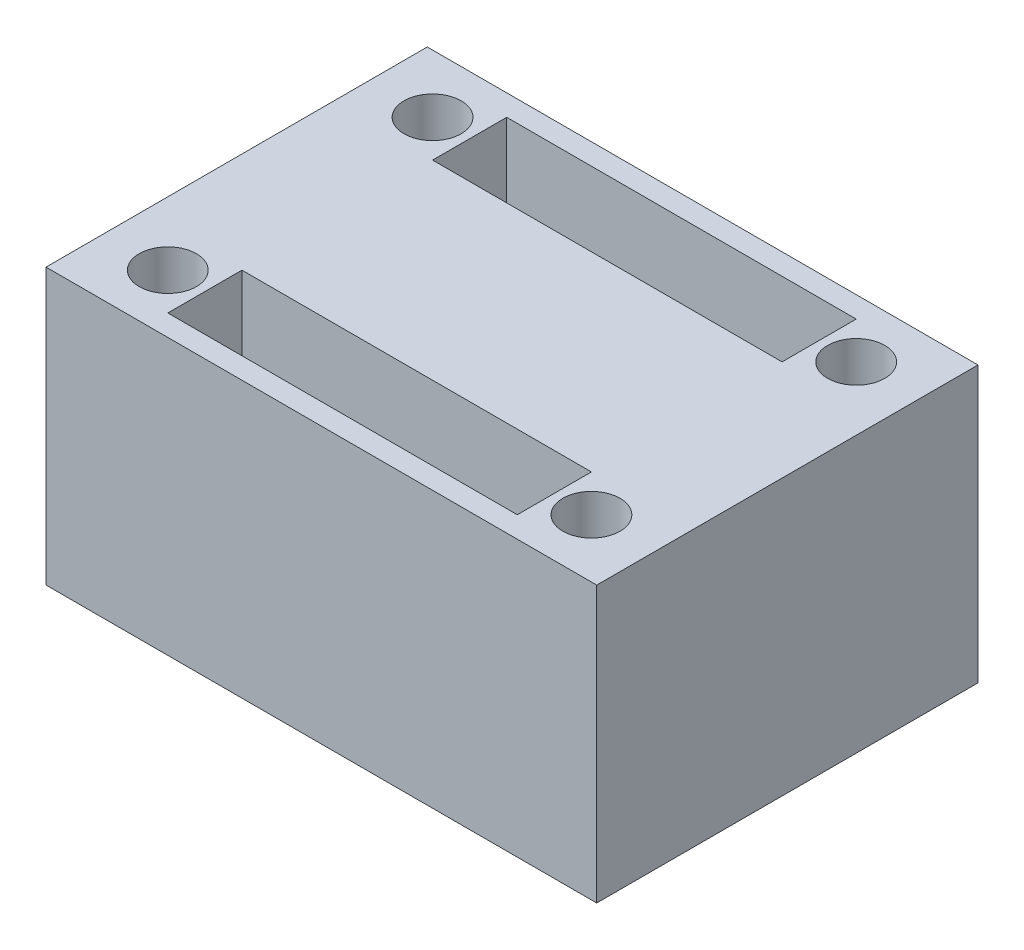
ISO-10303-21;
HEADER;
FILE_DESCRIPTION(('STEP AP214'),'2;1');
FILE_NAME('part.step','',(''),(''),'','','');
FILE_SCHEMA(('AUTOMOTIVE_DESIGN { 1 0 10303 214 1 1 1 1 }'));
ENDSEC;
DATA;
#1=APPLICATION_CONTEXT('core data for automotive mechanical design processes');
#2=APPLICATION_PROTOCOL_DEFINITION('international standard','automotive_design',2000,#1);
#3=PRODUCT_CONTEXT('',#1,'mechanical');
#4=PRODUCT('Part','Part','',(#3));
#5=PRODUCT_RELATED_PRODUCT_CATEGORY('part','',(#4));
#6=PRODUCT_DEFINITION_FORMATION('','',#4);
#7=PRODUCT_DEFINITION_CONTEXT('part definition',#1,'design');
#8=PRODUCT_DEFINITION('design','',#6,#7);
#9=PRODUCT_DEFINITION_SHAPE('','',#8);
#10=(LENGTH_UNIT() NAMED_UNIT(*) SI_UNIT(.MILLI.,.METRE.));
#11=(NAMED_UNIT(*) PLANE_ANGLE_UNIT() SI_UNIT($,.RADIAN.));
#12=(NAMED_UNIT(*) SI_UNIT($,.STERADIAN.) SOLID_ANGLE_UNIT());
#13=UNCERTAINTY_MEASURE_WITH_UNIT(LENGTH_MEASURE(1.E-05),#10,'distance_accuracy_value','');
#14=(GEOMETRIC_REPRESENTATION_CONTEXT(3) GLOBAL_UNCERTAINTY_ASSIGNED_CONTEXT((#13)) GLOBAL_UNIT_ASSIGNED_CONTEXT((#10,
#11,#12)) REPRESENTATION_CONTEXT('',''));
#15=CARTESIAN_POINT('',(0.,0.,0.));
#16=DIRECTION('',(0.,0.,1.));
#17=DIRECTION('',(1.,0.,0.));
#18=AXIS2_PLACEMENT_3D('',#15,#16,#17);
#19=CARTESIAN_POINT('',(0.,13.,0.));
#20=DIRECTION('',(1.,0.,0.));
#21=DIRECTION('',(0.,0.,-1.));
#22=AXIS2_PLACEMENT_3D('',#19,#20,#21);
#23=PLANE('',#22);
#24=DIRECTION('',(0.,0.,1.));
#25=VECTOR('',#24,1.);
#26=CARTESIAN_POINT('',(0.,0.,0.));
#27=LINE('',#26,#25);
#28=CARTESIAN_POINT('',(0.,0.,-18.));
#29=VERTEX_POINT('',#28);
#30=CARTESIAN_POINT('',(0.,0.,0.));
#31=VERTEX_POINT('',#30);
#32=EDGE_CURVE('E249',#29,#31,#27,.T.);
#33=ORIENTED_EDGE('',*,*,#32,.T.);
#34=DIRECTION('',(0.,-1.,0.));
#35=VECTOR('',#34,1.);
#36=CARTESIAN_POINT('',(0.,13.,0.));
#37=LINE('',#36,#35);
#38=CARTESIAN_POINT('',(0.,13.,0.));
#39=VERTEX_POINT('',#38);
#40=EDGE_CURVE('E11',#39,#31,#37,.T.);
#41=ORIENTED_EDGE('',*,*,#40,.F.);
#42=DIRECTION('',(0.,0.,1.));
#43=VECTOR('',#42,1.);
#44=CARTESIAN_POINT('',(0.,13.,0.));
#45=LINE('',#44,#43);
#46=CARTESIAN_POINT('',(0.,13.,-18.));
#47=VERTEX_POINT('',#46);
#48=EDGE_CURVE('E253',#47,#39,#45,.T.);
#49=ORIENTED_EDGE('',*,*,#48,.F.);
#50=DIRECTION('',(0.,-1.,0.));
#51=VECTOR('',#50,1.);
#52=CARTESIAN_POINT('',(0.,13.,-18.));
#53=LINE('',#52,#51);
#54=EDGE_CURVE('E267',#47,#29,#53,.T.);
#55=ORIENTED_EDGE('',*,*,#54,.T.);
#56=EDGE_LOOP('',(#33,#41,#49,#55));
#57=FACE_BOUND('',#56,.T.);
#58=ADVANCED_FACE('F38',(#57),#23,.F.);
#59=CARTESIAN_POINT('',(0.,13.,0.));
#60=DIRECTION('',(0.,0.,-1.));
#61=DIRECTION('',(-1.,0.,0.));
#62=AXIS2_PLACEMENT_3D('',#59,#60,#61);
#63=PLANE('',#62);
#64=DIRECTION('',(1.,0.,0.));
#65=VECTOR('',#64,1.);
#66=CARTESIAN_POINT('',(0.,0.,0.));
#67=LINE('',#66,#65);
#68=CARTESIAN_POINT('',(26.,0.,0.));
#69=VERTEX_POINT('',#68);
#70=EDGE_CURVE('E271',#31,#69,#67,.T.);
#71=ORIENTED_EDGE('',*,*,#70,.T.);
#72=DIRECTION('',(0.,-1.,0.));
#73=VECTOR('',#72,1.);
#74=CARTESIAN_POINT('',(26.,13.,0.));
#75=LINE('',#74,#73);
#76=CARTESIAN_POINT('',(26.,13.,0.));
#77=VERTEX_POINT('',#76);
#78=EDGE_CURVE('E46',#77,#69,#75,.T.);
#79=ORIENTED_EDGE('',*,*,#78,.F.);
#80=DIRECTION('',(1.,0.,0.));
#81=VECTOR('',#80,1.);
#82=CARTESIAN_POINT('',(0.,13.,0.));
#83=LINE('',#82,#81);
#84=EDGE_CURVE('E257',#39,#77,#83,.T.);
#85=ORIENTED_EDGE('',*,*,#84,.F.);
#86=ORIENTED_EDGE('',*,*,#40,.T.);
#87=EDGE_LOOP('',(#71,#79,#85,#86));
#88=FACE_BOUND('',#87,.T.);
#89=ADVANCED_FACE('F306',(#88),#63,.F.);
#90=CARTESIAN_POINT('',(26.,13.,0.));
#91=DIRECTION('',(-1.,0.,0.));
#92=DIRECTION('',(0.,0.,1.));
#93=AXIS2_PLACEMENT_3D('',#90,#91,#92);
#94=PLANE('',#93);
#95=DIRECTION('',(0.,0.,-1.));
#96=VECTOR('',#95,1.);
#97=CARTESIAN_POINT('',(26.,0.,0.));
#98=LINE('',#97,#96);
#99=CARTESIAN_POINT('',(26.,0.,-18.));
#100=VERTEX_POINT('',#99);
#101=EDGE_CURVE('E274',#69,#100,#98,.T.);
#102=ORIENTED_EDGE('',*,*,#101,.T.);
#103=DIRECTION('',(0.,-1.,0.));
#104=VECTOR('',#103,1.);
#105=CARTESIAN_POINT('',(26.,13.,-18.));
#106=LINE('',#105,#104);
#107=CARTESIAN_POINT('',(26.,13.,-18.));
#108=VERTEX_POINT('',#107);
#109=EDGE_CURVE('E282',#108,#100,#106,.T.);
#110=ORIENTED_EDGE('',*,*,#109,.F.);
#111=DIRECTION('',(0.,0.,-1.));
#112=VECTOR('',#111,1.);
#113=CARTESIAN_POINT('',(26.,13.,0.));
#114=LINE('',#113,#112);
#115=EDGE_CURVE('E261',#77,#108,#114,.T.);
#116=ORIENTED_EDGE('',*,*,#115,.F.);
#117=ORIENTED_EDGE('',*,*,#78,.T.);
#118=EDGE_LOOP('',(#102,#110,#116,#117));
#119=FACE_BOUND('',#118,.T.);
#120=ADVANCED_FACE('F291',(#119),#94,.F.);
#121=CARTESIAN_POINT('',(0.,13.,-18.));
#122=DIRECTION('',(0.,0.,1.));
#123=DIRECTION('',(1.,0.,0.));
#124=AXIS2_PLACEMENT_3D('',#121,#122,#123);
#125=PLANE('',#124);
#126=DIRECTION('',(-1.,0.,0.));
#127=VECTOR('',#126,1.);
#128=CARTESIAN_POINT('',(0.,0.,-18.));
#129=LINE('',#128,#127);
#130=EDGE_CURVE('E258',#100,#29,#129,.T.);
#131=ORIENTED_EDGE('',*,*,#130,.T.);
#132=ORIENTED_EDGE('',*,*,#54,.F.);
#133=DIRECTION('',(-1.,0.,0.));
#134=VECTOR('',#133,1.);
#135=CARTESIAN_POINT('',(0.,13.,-18.));
#136=LINE('',#135,#134);
#137=EDGE_CURVE('E264',#108,#47,#136,.T.);
#138=ORIENTED_EDGE('',*,*,#137,.F.);
#139=ORIENTED_EDGE('',*,*,#109,.T.);
#140=EDGE_LOOP('',(#131,#132,#138,#139));
#141=FACE_BOUND('',#140,.T.);
#142=ADVANCED_FACE('F299',(#141),#125,.F.);
#143=CARTESIAN_POINT('',(0.,13.,0.));
#144=DIRECTION('',(0.,-1.,0.));
#145=DIRECTION('',(0.,0.,-1.));
#146=AXIS2_PLACEMENT_3D('',#143,#144,#145);
#147=PLANE('',#146);
#148=DIRECTION('',(1.,0.,0.));
#149=VECTOR('',#148,1.);
#150=CARTESIAN_POINT('',(4.75,13.,-0.999999999999996));
#151=LINE('',#150,#149);
#152=CARTESIAN_POINT('',(4.75,13.,-0.999999999999996));
#153=VERTEX_POINT('',#152);
#154=CARTESIAN_POINT('',(21.25,13.,-0.999999999999998));
#155=VERTEX_POINT('',#154);
#156=EDGE_CURVE('E208',#153,#155,#151,.T.);
#157=ORIENTED_EDGE('',*,*,#156,.F.);
#158=DIRECTION('',(0.,0.,1.));
#159=VECTOR('',#158,1.);
#160=CARTESIAN_POINT('',(4.75,13.,-4.5));
#161=LINE('',#160,#159);
#162=CARTESIAN_POINT('',(4.75,13.,-4.5));
#163=VERTEX_POINT('',#162);
#164=EDGE_CURVE('E53',#163,#153,#161,.T.);
#165=ORIENTED_EDGE('',*,*,#164,.F.);
#166=DIRECTION('',(-1.,0.,0.));
#167=VECTOR('',#166,1.);
#168=CARTESIAN_POINT('',(4.75,13.,-4.5));
#169=LINE('',#168,#167);
#170=CARTESIAN_POINT('',(21.25,13.,-4.5));
#171=VERTEX_POINT('',#170);
#172=EDGE_CURVE('E193',#171,#163,#169,.T.);
#173=ORIENTED_EDGE('',*,*,#172,.F.);
#174=DIRECTION('',(0.,0.,-1.));
#175=VECTOR('',#174,1.);
#176=CARTESIAN_POINT('',(21.25,13.,-4.5));
#177=LINE('',#176,#175);
#178=EDGE_CURVE('E212',#155,#171,#177,.T.);
#179=ORIENTED_EDGE('',*,*,#178,.F.);
#180=EDGE_LOOP('',(#157,#165,#173,#179));
#181=FACE_BOUND('',#180,.T.);
#182=CARTESIAN_POINT('',(23.,13.,-2.75));
#183=DIRECTION('',(0.,1.,0.));
#184=DIRECTION('',(0.,0.,1.));
#185=AXIS2_PLACEMENT_3D('',#182,#183,#184);
#186=CIRCLE('',#185,1.35);
#187=CARTESIAN_POINT('',(23.,13.,-1.4));
#188=VERTEX_POINT('',#187);
#189=EDGE_CURVE('E183',#188,#188,#186,.T.);
#190=ORIENTED_EDGE('',*,*,#189,.F.);
#191=EDGE_LOOP('',(#190));
#192=FACE_BOUND('',#191,.T.);
#193=CARTESIAN_POINT('',(3.,13.,-2.75));
#194=DIRECTION('',(0.,1.,0.));
#195=DIRECTION('',(0.,0.,1.));
#196=AXIS2_PLACEMENT_3D('',#193,#194,#195);
#197=CIRCLE('',#196,1.35);
#198=CARTESIAN_POINT('',(3.,13.,-1.4));
#199=VERTEX_POINT('',#198);
#200=EDGE_CURVE('E182',#199,#199,#197,.T.);
#201=ORIENTED_EDGE('',*,*,#200,.F.);
#202=EDGE_LOOP('',(#201));
#203=FACE_BOUND('',#202,.T.);
#204=CARTESIAN_POINT('',(23.,13.,-15.25));
#205=DIRECTION('',(0.,1.,0.));
#206=DIRECTION('',(0.,0.,1.));
#207=AXIS2_PLACEMENT_3D('',#204,#205,#206);
#208=CIRCLE('',#207,1.35);
#209=CARTESIAN_POINT('',(23.,13.,-13.9));
#210=VERTEX_POINT('',#209);
#211=EDGE_CURVE('E234',#210,#210,#208,.T.);
#212=ORIENTED_EDGE('',*,*,#211,.F.);
#213=EDGE_LOOP('',(#212));
#214=FACE_BOUND('',#213,.T.);
#215=DIRECTION('',(0.,0.,-1.));
#216=VECTOR('',#215,1.);
#217=CARTESIAN_POINT('',(21.25,13.,-13.5));
#218=LINE('',#217,#216);
#219=CARTESIAN_POINT('',(21.25,13.,-13.5));
#220=VERTEX_POINT('',#219);
#221=CARTESIAN_POINT('',(21.25,13.,-17.));
#222=VERTEX_POINT('',#221);
#223=EDGE_CURVE('E164',#220,#222,#218,.T.);
#224=ORIENTED_EDGE('',*,*,#223,.F.);
#225=DIRECTION('',(1.,0.,0.));
#226=VECTOR('',#225,1.);
#227=CARTESIAN_POINT('',(4.75,13.,-13.5));
#228=LINE('',#227,#226);
#229=CARTESIAN_POINT('',(4.75,13.,-13.5));
#230=VERTEX_POINT('',#229);
#231=EDGE_CURVE('E61',#230,#220,#228,.T.);
#232=ORIENTED_EDGE('',*,*,#231,.F.);
#233=DIRECTION('',(0.,0.,1.));
#234=VECTOR('',#233,1.);
#235=CARTESIAN_POINT('',(4.75,13.,-13.5));
#236=LINE('',#235,#234);
#237=CARTESIAN_POINT('',(4.75,13.,-17.));
#238=VERTEX_POINT('',#237);
#239=EDGE_CURVE('E151',#238,#230,#236,.T.);
#240=ORIENTED_EDGE('',*,*,#239,.F.);
#241=DIRECTION('',(-1.,0.,0.));
#242=VECTOR('',#241,1.);
#243=CARTESIAN_POINT('',(4.75,13.,-17.));
#244=LINE('',#243,#242);
#245=EDGE_CURVE('E155',#222,#238,#244,.T.);
#246=ORIENTED_EDGE('',*,*,#245,.F.);
#247=EDGE_LOOP('',(#224,#232,#240,#246));
#248=FACE_BOUND('',#247,.T.);
#249=CARTESIAN_POINT('',(3.,13.,-15.25));
#250=DIRECTION('',(0.,1.,0.));
#251=DIRECTION('',(0.,0.,1.));
#252=AXIS2_PLACEMENT_3D('',#249,#250,#251);
#253=CIRCLE('',#252,1.35);
#254=CARTESIAN_POINT('',(3.,13.,-13.9));
#255=VERTEX_POINT('',#254);
#256=EDGE_CURVE('E233',#255,#255,#253,.T.);
#257=ORIENTED_EDGE('',*,*,#256,.F.);
#258=EDGE_LOOP('',(#257));
#259=FACE_BOUND('',#258,.T.);
#260=ORIENTED_EDGE('',*,*,#48,.T.);
#261=ORIENTED_EDGE('',*,*,#84,.T.);
#262=ORIENTED_EDGE('',*,*,#115,.T.);
#263=ORIENTED_EDGE('',*,*,#137,.T.);
#264=EDGE_LOOP('',(#260,#261,#262,#263));
#265=FACE_BOUND('',#264,.T.);
#266=ADVANCED_FACE('F305',(#181,#192,#203,#214,#248,#259,#265),#147,.F.);
#267=CARTESIAN_POINT('',(0.,0.,0.));
#268=DIRECTION('',(0.,-1.,0.));
#269=DIRECTION('',(0.,0.,-1.));
#270=AXIS2_PLACEMENT_3D('',#267,#268,#269);
#271=PLANE('',#270);
#272=DIRECTION('',(0.,0.,1.));
#273=VECTOR('',#272,1.);
#274=CARTESIAN_POINT('',(4.75,0.,-4.5));
#275=LINE('',#274,#273);
#276=CARTESIAN_POINT('',(4.75,0.,-4.5));
#277=VERTEX_POINT('',#276);
#278=CARTESIAN_POINT('',(4.75,0.,-0.999999999999996));
#279=VERTEX_POINT('',#278);
#280=EDGE_CURVE('E188',#277,#279,#275,.T.);
#281=ORIENTED_EDGE('',*,*,#280,.T.);
#282=DIRECTION('',(1.,0.,0.));
#283=VECTOR('',#282,1.);
#284=CARTESIAN_POINT('',(4.75,0.,-0.999999999999996));
#285=LINE('',#284,#283);
#286=CARTESIAN_POINT('',(21.25,0.,-0.999999999999998));
#287=VERTEX_POINT('',#286);
#288=EDGE_CURVE('E192',#279,#287,#285,.T.);
#289=ORIENTED_EDGE('',*,*,#288,.T.);
#290=DIRECTION('',(0.,0.,-1.));
#291=VECTOR('',#290,1.);
#292=CARTESIAN_POINT('',(21.25,0.,-4.5));
#293=LINE('',#292,#291);
#294=CARTESIAN_POINT('',(21.25,0.,-4.5));
#295=VERTEX_POINT('',#294);
#296=EDGE_CURVE('E197',#287,#295,#293,.T.);
#297=ORIENTED_EDGE('',*,*,#296,.T.);
#298=DIRECTION('',(-1.,0.,0.));
#299=VECTOR('',#298,1.);
#300=CARTESIAN_POINT('',(4.75,0.,-4.5));
#301=LINE('',#300,#299);
#302=EDGE_CURVE('E201',#295,#277,#301,.T.);
#303=ORIENTED_EDGE('',*,*,#302,.T.);
#304=EDGE_LOOP('',(#281,#289,#297,#303));
#305=FACE_BOUND('',#304,.T.);
#306=CARTESIAN_POINT('',(23.,0.,-2.75));
#307=DIRECTION('',(0.,1.,0.));
#308=DIRECTION('',(0.,0.,1.));
#309=AXIS2_PLACEMENT_3D('',#306,#307,#308);
#310=CIRCLE('',#309,1.35);
#311=CARTESIAN_POINT('',(23.,0.,-1.4));
#312=VERTEX_POINT('',#311);
#313=EDGE_CURVE('E178',#312,#312,#310,.T.);
#314=ORIENTED_EDGE('',*,*,#313,.T.);
#315=EDGE_LOOP('',(#314));
#316=FACE_BOUND('',#315,.T.);
#317=CARTESIAN_POINT('',(3.,0.,-2.75));
#318=DIRECTION('',(0.,1.,0.));
#319=DIRECTION('',(0.,0.,1.));
#320=AXIS2_PLACEMENT_3D('',#317,#318,#319);
#321=CIRCLE('',#320,1.35);
#322=CARTESIAN_POINT('',(3.,0.,-1.4));
#323=VERTEX_POINT('',#322);
#324=EDGE_CURVE('E238',#323,#323,#321,.T.);
#325=ORIENTED_EDGE('',*,*,#324,.T.);
#326=EDGE_LOOP('',(#325));
#327=FACE_BOUND('',#326,.T.);
#328=CARTESIAN_POINT('',(23.,0.,-15.25));
#329=DIRECTION('',(0.,1.,0.));
#330=DIRECTION('',(0.,0.,1.));
#331=AXIS2_PLACEMENT_3D('',#328,#329,#330);
#332=CIRCLE('',#331,1.35);
#333=CARTESIAN_POINT('',(23.,0.,-13.9));
#334=VERTEX_POINT('',#333);
#335=EDGE_CURVE('E229',#334,#334,#332,.T.);
#336=ORIENTED_EDGE('',*,*,#335,.T.);
#337=EDGE_LOOP('',(#336));
#338=FACE_BOUND('',#337,.T.);
#339=DIRECTION('',(1.,0.,0.));
#340=VECTOR('',#339,1.);
#341=CARTESIAN_POINT('',(4.75,0.,-13.5));
#342=LINE('',#341,#340);
#343=CARTESIAN_POINT('',(4.75,0.,-13.5));
#344=VERTEX_POINT('',#343);
#345=CARTESIAN_POINT('',(21.25,0.,-13.5));
#346=VERTEX_POINT('',#345);
#347=EDGE_CURVE('E129',#344,#346,#342,.T.);
#348=ORIENTED_EDGE('',*,*,#347,.T.);
#349=DIRECTION('',(0.,0.,-1.));
#350=VECTOR('',#349,1.);
#351=CARTESIAN_POINT('',(21.25,0.,-13.5));
#352=LINE('',#351,#350);
#353=CARTESIAN_POINT('',(21.25,0.,-17.));
#354=VERTEX_POINT('',#353);
#355=EDGE_CURVE('E140',#346,#354,#352,.T.);
#356=ORIENTED_EDGE('',*,*,#355,.T.);
#357=DIRECTION('',(-1.,0.,0.));
#358=VECTOR('',#357,1.);
#359=CARTESIAN_POINT('',(4.75,0.,-17.));
#360=LINE('',#359,#358);
#361=CARTESIAN_POINT('',(4.75,0.,-17.));
#362=VERTEX_POINT('',#361);
#363=EDGE_CURVE('E145',#354,#362,#360,.T.);
#364=ORIENTED_EDGE('',*,*,#363,.T.);
#365=DIRECTION('',(0.,0.,1.));
#366=VECTOR('',#365,1.);
#367=CARTESIAN_POINT('',(4.75,0.,-13.5));
#368=LINE('',#367,#366);
#369=EDGE_CURVE('E136',#362,#344,#368,.T.);
#370=ORIENTED_EDGE('',*,*,#369,.T.);
#371=EDGE_LOOP('',(#348,#356,#364,#370));
#372=FACE_BOUND('',#371,.T.);
#373=CARTESIAN_POINT('',(3.,0.,-15.25));
#374=DIRECTION('',(0.,1.,0.));
#375=DIRECTION('',(0.,0.,1.));
#376=AXIS2_PLACEMENT_3D('',#373,#374,#375);
#377=CIRCLE('',#376,1.35);
#378=CARTESIAN_POINT('',(3.,0.,-13.9));
#379=VERTEX_POINT('',#378);
#380=EDGE_CURVE('E245',#379,#379,#377,.T.);
#381=ORIENTED_EDGE('',*,*,#380,.T.);
#382=EDGE_LOOP('',(#381));
#383=FACE_BOUND('',#382,.T.);
#384=ORIENTED_EDGE('',*,*,#32,.F.);
#385=ORIENTED_EDGE('',*,*,#130,.F.);
#386=ORIENTED_EDGE('',*,*,#101,.F.);
#387=ORIENTED_EDGE('',*,*,#70,.F.);
#388=EDGE_LOOP('',(#384,#385,#386,#387));
#389=FACE_BOUND('',#388,.T.);
#390=ADVANCED_FACE('F147',(#305,#316,#327,#338,#372,#383,#389),#271,.T.);
#391=CARTESIAN_POINT('',(3.,0.,-15.25));
#392=DIRECTION('',(0.,1.,0.));
#393=DIRECTION('',(0.,0.,1.));
#394=AXIS2_PLACEMENT_3D('',#391,#392,#393);
#395=CYLINDRICAL_SURFACE('',#394,1.35);
#396=ORIENTED_EDGE('',*,*,#380,.F.);
#397=EDGE_LOOP('',(#396));
#398=FACE_BOUND('',#397,.T.);
#399=ORIENTED_EDGE('',*,*,#256,.T.);
#400=EDGE_LOOP('',(#399));
#401=FACE_BOUND('',#400,.T.);
#402=ADVANCED_FACE('F318',(#398,#401),#395,.F.);
#403=CARTESIAN_POINT('',(4.75,0.,-13.5));
#404=DIRECTION('',(0.,0.,1.));
#405=DIRECTION('',(1.,0.,0.));
#406=AXIS2_PLACEMENT_3D('',#403,#404,#405);
#407=PLANE('',#406);
#408=ORIENTED_EDGE('',*,*,#231,.T.);
#409=DIRECTION('',(0.,1.,0.));
#410=VECTOR('',#409,1.);
#411=CARTESIAN_POINT('',(21.25,0.,-13.5));
#412=LINE('',#411,#410);
#413=EDGE_CURVE('E125',#346,#220,#412,.T.);
#414=ORIENTED_EDGE('',*,*,#413,.F.);
#415=ORIENTED_EDGE('',*,*,#347,.F.);
#416=DIRECTION('',(0.,1.,0.));
#417=VECTOR('',#416,1.);
#418=CARTESIAN_POINT('',(4.75,0.,-13.5));
#419=LINE('',#418,#417);
#420=EDGE_CURVE('E170',#344,#230,#419,.T.);
#421=ORIENTED_EDGE('',*,*,#420,.T.);
#422=EDGE_LOOP('',(#408,#414,#415,#421));
#423=FACE_BOUND('',#422,.T.);
#424=ADVANCED_FACE('F127',(#423),#407,.F.);
#425=CARTESIAN_POINT('',(4.75,0.,-13.5));
#426=DIRECTION('',(-1.,0.,0.));
#427=DIRECTION('',(0.,0.,1.));
#428=AXIS2_PLACEMENT_3D('',#425,#426,#427);
#429=PLANE('',#428);
#430=ORIENTED_EDGE('',*,*,#239,.T.);
#431=ORIENTED_EDGE('',*,*,#420,.F.);
#432=ORIENTED_EDGE('',*,*,#369,.F.);
#433=DIRECTION('',(0.,1.,0.));
#434=VECTOR('',#433,1.);
#435=CARTESIAN_POINT('',(4.75,0.,-17.));
#436=LINE('',#435,#434);
#437=EDGE_CURVE('E173',#362,#238,#436,.T.);
#438=ORIENTED_EDGE('',*,*,#437,.T.);
#439=EDGE_LOOP('',(#430,#431,#432,#438));
#440=FACE_BOUND('',#439,.T.);
#441=ADVANCED_FACE('F355',(#440),#429,.F.);
#442=CARTESIAN_POINT('',(4.75,0.,-17.));
#443=DIRECTION('',(0.,0.,-1.));
#444=DIRECTION('',(-1.,0.,0.));
#445=AXIS2_PLACEMENT_3D('',#442,#443,#444);
#446=PLANE('',#445);
#447=ORIENTED_EDGE('',*,*,#245,.T.);
#448=ORIENTED_EDGE('',*,*,#437,.F.);
#449=ORIENTED_EDGE('',*,*,#363,.F.);
#450=DIRECTION('',(0.,1.,0.));
#451=VECTOR('',#450,1.);
#452=CARTESIAN_POINT('',(21.25,0.,-17.));
#453=LINE('',#452,#451);
#454=EDGE_CURVE('E135',#354,#222,#453,.T.);
#455=ORIENTED_EDGE('',*,*,#454,.T.);
#456=EDGE_LOOP('',(#447,#448,#449,#455));
#457=FACE_BOUND('',#456,.T.);
#458=ADVANCED_FACE('F358',(#457),#446,.F.);
#459=CARTESIAN_POINT('',(21.25,0.,-13.5));
#460=DIRECTION('',(1.,0.,0.));
#461=DIRECTION('',(0.,0.,-1.));
#462=AXIS2_PLACEMENT_3D('',#459,#460,#461);
#463=PLANE('',#462);
#464=ORIENTED_EDGE('',*,*,#223,.T.);
#465=ORIENTED_EDGE('',*,*,#454,.F.);
#466=ORIENTED_EDGE('',*,*,#355,.F.);
#467=ORIENTED_EDGE('',*,*,#413,.T.);
#468=EDGE_LOOP('',(#464,#465,#466,#467));
#469=FACE_BOUND('',#468,.T.);
#470=ADVANCED_FACE('F141',(#469),#463,.F.);
#471=CARTESIAN_POINT('',(23.,0.,-15.25));
#472=DIRECTION('',(0.,1.,0.));
#473=DIRECTION('',(0.,0.,1.));
#474=AXIS2_PLACEMENT_3D('',#471,#472,#473);
#475=CYLINDRICAL_SURFACE('',#474,1.35);
#476=ORIENTED_EDGE('',*,*,#335,.F.);
#477=EDGE_LOOP('',(#476));
#478=FACE_BOUND('',#477,.T.);
#479=ORIENTED_EDGE('',*,*,#211,.T.);
#480=EDGE_LOOP('',(#479));
#481=FACE_BOUND('',#480,.T.);
#482=ADVANCED_FACE('F330',(#478,#481),#475,.F.);
#483=CARTESIAN_POINT('',(3.,0.,-2.75));
#484=DIRECTION('',(0.,1.,0.));
#485=DIRECTION('',(0.,0.,1.));
#486=AXIS2_PLACEMENT_3D('',#483,#484,#485);
#487=CYLINDRICAL_SURFACE('',#486,1.35);
#488=ORIENTED_EDGE('',*,*,#324,.F.);
#489=EDGE_LOOP('',(#488));
#490=FACE_BOUND('',#489,.T.);
#491=ORIENTED_EDGE('',*,*,#200,.T.);
#492=EDGE_LOOP('',(#491));
#493=FACE_BOUND('',#492,.T.);
#494=ADVANCED_FACE('F326',(#490,#493),#487,.F.);
#495=CARTESIAN_POINT('',(23.,0.,-2.75));
#496=DIRECTION('',(0.,1.,0.));
#497=DIRECTION('',(0.,0.,1.));
#498=AXIS2_PLACEMENT_3D('',#495,#496,#497);
#499=CYLINDRICAL_SURFACE('',#498,1.35);
#500=ORIENTED_EDGE('',*,*,#313,.F.);
#501=EDGE_LOOP('',(#500));
#502=FACE_BOUND('',#501,.T.);
#503=ORIENTED_EDGE('',*,*,#189,.T.);
#504=EDGE_LOOP('',(#503));
#505=FACE_BOUND('',#504,.T.);
#506=ADVANCED_FACE('F329',(#502,#505),#499,.F.);
#507=CARTESIAN_POINT('',(4.75,0.,-4.5));
#508=DIRECTION('',(-1.,0.,0.));
#509=DIRECTION('',(0.,0.,1.));
#510=AXIS2_PLACEMENT_3D('',#507,#508,#509);
#511=PLANE('',#510);
#512=ORIENTED_EDGE('',*,*,#164,.T.);
#513=DIRECTION('',(0.,1.,0.));
#514=VECTOR('',#513,1.);
#515=CARTESIAN_POINT('',(4.75,0.,-0.999999999999996));
#516=LINE('',#515,#514);
#517=EDGE_CURVE('E205',#279,#153,#516,.T.);
#518=ORIENTED_EDGE('',*,*,#517,.F.);
#519=ORIENTED_EDGE('',*,*,#280,.F.);
#520=DIRECTION('',(0.,1.,0.));
#521=VECTOR('',#520,1.);
#522=CARTESIAN_POINT('',(4.75,0.,-4.5));
#523=LINE('',#522,#521);
#524=EDGE_CURVE('E187',#277,#163,#523,.T.);
#525=ORIENTED_EDGE('',*,*,#524,.T.);
#526=EDGE_LOOP('',(#512,#518,#519,#525));
#527=FACE_BOUND('',#526,.T.);
#528=ADVANCED_FACE('F335',(#527),#511,.F.);
#529=CARTESIAN_POINT('',(4.75,0.,-4.5));
#530=DIRECTION('',(0.,0.,-1.));
#531=DIRECTION('',(-1.,0.,0.));
#532=AXIS2_PLACEMENT_3D('',#529,#530,#531);
#533=PLANE('',#532);
#534=ORIENTED_EDGE('',*,*,#172,.T.);
#535=ORIENTED_EDGE('',*,*,#524,.F.);
#536=ORIENTED_EDGE('',*,*,#302,.F.);
#537=DIRECTION('',(0.,1.,0.));
#538=VECTOR('',#537,1.);
#539=CARTESIAN_POINT('',(21.25,0.,-4.5));
#540=LINE('',#539,#538);
#541=EDGE_CURVE('E221',#295,#171,#540,.T.);
#542=ORIENTED_EDGE('',*,*,#541,.T.);
#543=EDGE_LOOP('',(#534,#535,#536,#542));
#544=FACE_BOUND('',#543,.T.);
#545=ADVANCED_FACE('F338',(#544),#533,.F.);
#546=CARTESIAN_POINT('',(21.25,0.,-4.5));
#547=DIRECTION('',(1.,0.,0.));
#548=DIRECTION('',(0.,0.,-1.));
#549=AXIS2_PLACEMENT_3D('',#546,#547,#548);
#550=PLANE('',#549);
#551=ORIENTED_EDGE('',*,*,#178,.T.);
#552=ORIENTED_EDGE('',*,*,#541,.F.);
#553=ORIENTED_EDGE('',*,*,#296,.F.);
#554=DIRECTION('',(0.,1.,0.));
#555=VECTOR('',#554,1.);
#556=CARTESIAN_POINT('',(21.25,0.,-0.999999999999998));
#557=LINE('',#556,#555);
#558=EDGE_CURVE('E224',#287,#155,#557,.T.);
#559=ORIENTED_EDGE('',*,*,#558,.T.);
#560=EDGE_LOOP('',(#551,#552,#553,#559));
#561=FACE_BOUND('',#560,.T.);
#562=ADVANCED_FACE('F342',(#561),#550,.F.);
#563=CARTESIAN_POINT('',(4.75,0.,-0.999999999999996));
#564=DIRECTION('',(0.,0.,1.));
#565=DIRECTION('',(1.,0.,0.));
#566=AXIS2_PLACEMENT_3D('',#563,#564,#565);
#567=PLANE('',#566);
#568=ORIENTED_EDGE('',*,*,#156,.T.);
#569=ORIENTED_EDGE('',*,*,#558,.F.);
#570=ORIENTED_EDGE('',*,*,#288,.F.);
#571=ORIENTED_EDGE('',*,*,#517,.T.);
#572=EDGE_LOOP('',(#568,#569,#570,#571));
#573=FACE_BOUND('',#572,.T.);
#574=ADVANCED_FACE('F339',(#573),#567,.F.);
#575=CLOSED_SHELL('',(#58,#89,#120,#142,#266,#390,#402,#424,#441,#458,#470,#482,#494,#506,#528,
#545,#562,#574));
#576=MANIFOLD_SOLID_BREP('B2',#575);
#577=ADVANCED_BREP_SHAPE_REPRESENTATION('',(#18,#576),#14);
#578=SHAPE_DEFINITION_REPRESENTATION(#9,#577);
ENDSEC;
END-ISO-10303-21;
